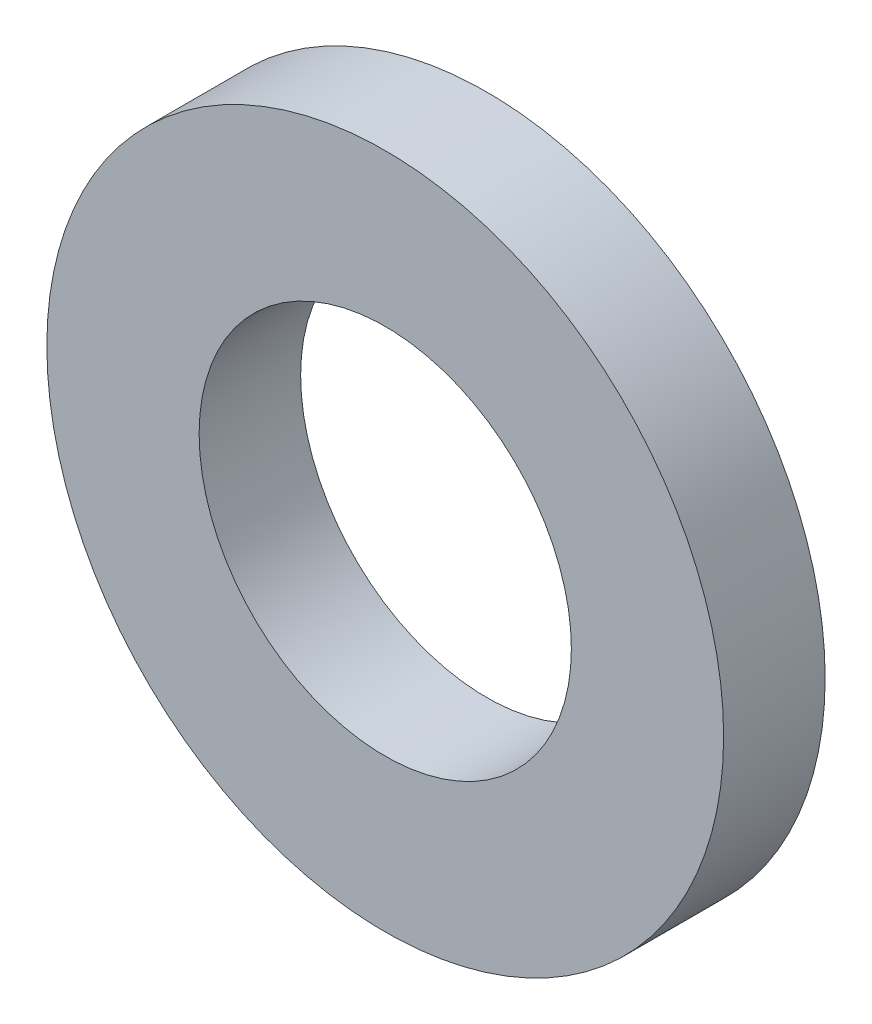
ISO-10303-21;
HEADER;
FILE_DESCRIPTION(('STEP AP214'),'2;1');
FILE_NAME('part.step','',(''),(''),'','','');
FILE_SCHEMA(('AUTOMOTIVE_DESIGN { 1 0 10303 214 1 1 1 1 }'));
ENDSEC;
DATA;
#1=APPLICATION_CONTEXT('core data for automotive mechanical design processes');
#2=APPLICATION_PROTOCOL_DEFINITION('international standard','automotive_design',2000,#1);
#3=PRODUCT_CONTEXT('',#1,'mechanical');
#4=PRODUCT('Part','Part','',(#3));
#5=PRODUCT_RELATED_PRODUCT_CATEGORY('part','',(#4));
#6=PRODUCT_DEFINITION_FORMATION('','',#4);
#7=PRODUCT_DEFINITION_CONTEXT('part definition',#1,'design');
#8=PRODUCT_DEFINITION('design','',#6,#7);
#9=PRODUCT_DEFINITION_SHAPE('','',#8);
#10=(LENGTH_UNIT() NAMED_UNIT(*) SI_UNIT(.MILLI.,.METRE.));
#11=(NAMED_UNIT(*) PLANE_ANGLE_UNIT() SI_UNIT($,.RADIAN.));
#12=(NAMED_UNIT(*) SI_UNIT($,.STERADIAN.) SOLID_ANGLE_UNIT());
#13=UNCERTAINTY_MEASURE_WITH_UNIT(LENGTH_MEASURE(1.E-05),#10,'distance_accuracy_value','');
#14=(GEOMETRIC_REPRESENTATION_CONTEXT(3) GLOBAL_UNCERTAINTY_ASSIGNED_CONTEXT((#13)) GLOBAL_UNIT_ASSIGNED_CONTEXT((#10,
#11,#12)) REPRESENTATION_CONTEXT('',''));
#15=CARTESIAN_POINT('',(0.,0.,0.));
#16=DIRECTION('',(0.,0.,1.));
#17=DIRECTION('',(1.,0.,0.));
#18=AXIS2_PLACEMENT_3D('',#15,#16,#17);
#19=CARTESIAN_POINT('',(0.,0.,1.5));
#20=DIRECTION('',(0.,0.,-1.));
#21=DIRECTION('',(-1.,0.,0.));
#22=AXIS2_PLACEMENT_3D('',#19,#20,#21);
#23=PLANE('',#22);
#24=CARTESIAN_POINT('',(0.,0.,1.5));
#25=DIRECTION('',(0.,0.,1.));
#26=DIRECTION('',(1.,0.,0.));
#27=AXIS2_PLACEMENT_3D('',#24,#25,#26);
#28=CIRCLE('',#27,2.75);
#29=CARTESIAN_POINT('',(2.75,0.,1.5));
#30=VERTEX_POINT('',#29);
#31=EDGE_CURVE('E26',#30,#30,#28,.F.);
#32=ORIENTED_EDGE('',*,*,#31,.T.);
#33=EDGE_LOOP('',(#32));
#34=FACE_BOUND('',#33,.T.);
#35=CARTESIAN_POINT('',(0.,0.,1.5));
#36=DIRECTION('',(0.,0.,1.));
#37=DIRECTION('',(1.,0.,0.));
#38=AXIS2_PLACEMENT_3D('',#35,#36,#37);
#39=CIRCLE('',#38,5.);
#40=CARTESIAN_POINT('',(5.,0.,1.5));
#41=VERTEX_POINT('',#40);
#42=EDGE_CURVE('E17',#41,#41,#39,.F.);
#43=ORIENTED_EDGE('',*,*,#42,.F.);
#44=EDGE_LOOP('',(#43));
#45=FACE_BOUND('',#44,.T.);
#46=ADVANCED_FACE('F14',(#34,#45),#23,.F.);
#47=CARTESIAN_POINT('',(0.,0.,0.));
#48=DIRECTION('',(0.,0.,1.));
#49=DIRECTION('',(1.,0.,0.));
#50=AXIS2_PLACEMENT_3D('',#47,#48,#49);
#51=CYLINDRICAL_SURFACE('',#50,5.);
#52=CARTESIAN_POINT('',(0.,0.,0.));
#53=DIRECTION('',(0.,0.,1.));
#54=DIRECTION('',(1.,0.,0.));
#55=AXIS2_PLACEMENT_3D('',#52,#53,#54);
#56=CIRCLE('',#55,5.);
#57=CARTESIAN_POINT('',(5.,0.,0.));
#58=VERTEX_POINT('',#57);
#59=EDGE_CURVE('E21',#58,#58,#56,.F.);
#60=ORIENTED_EDGE('',*,*,#59,.F.);
#61=EDGE_LOOP('',(#60));
#62=FACE_BOUND('',#61,.T.);
#63=ORIENTED_EDGE('',*,*,#42,.T.);
#64=EDGE_LOOP('',(#63));
#65=FACE_BOUND('',#64,.T.);
#66=ADVANCED_FACE('F34',(#62,#65),#51,.T.);
#67=CARTESIAN_POINT('',(0.,0.,0.));
#68=DIRECTION('',(0.,0.,1.));
#69=DIRECTION('',(1.,0.,0.));
#70=AXIS2_PLACEMENT_3D('',#67,#68,#69);
#71=CYLINDRICAL_SURFACE('',#70,2.75);
#72=CARTESIAN_POINT('',(0.,0.,0.));
#73=DIRECTION('',(0.,0.,1.));
#74=DIRECTION('',(1.,0.,0.));
#75=AXIS2_PLACEMENT_3D('',#72,#73,#74);
#76=CIRCLE('',#75,2.75);
#77=CARTESIAN_POINT('',(2.75,0.,0.));
#78=VERTEX_POINT('',#77);
#79=EDGE_CURVE('E10',#78,#78,#76,.T.);
#80=ORIENTED_EDGE('',*,*,#79,.F.);
#81=EDGE_LOOP('',(#80));
#82=FACE_BOUND('',#81,.T.);
#83=ORIENTED_EDGE('',*,*,#31,.F.);
#84=EDGE_LOOP('',(#83));
#85=FACE_BOUND('',#84,.T.);
#86=ADVANCED_FACE('F41',(#82,#85),#71,.F.);
#87=CARTESIAN_POINT('',(0.,0.,0.));
#88=DIRECTION('',(0.,0.,-1.));
#89=DIRECTION('',(-1.,0.,0.));
#90=AXIS2_PLACEMENT_3D('',#87,#88,#89);
#91=PLANE('',#90);
#92=ORIENTED_EDGE('',*,*,#79,.T.);
#93=EDGE_LOOP('',(#92));
#94=FACE_BOUND('',#93,.T.);
#95=ORIENTED_EDGE('',*,*,#59,.T.);
#96=EDGE_LOOP('',(#95));
#97=FACE_BOUND('',#96,.T.);
#98=ADVANCED_FACE('F43',(#94,#97),#91,.T.);
#99=CLOSED_SHELL('',(#46,#66,#86,#98));
#100=MANIFOLD_SOLID_BREP('B1',#99);
#101=ADVANCED_BREP_SHAPE_REPRESENTATION('',(#18,#100),#14);
#102=SHAPE_DEFINITION_REPRESENTATION(#9,#101);
ENDSEC;
END-ISO-10303-21;
